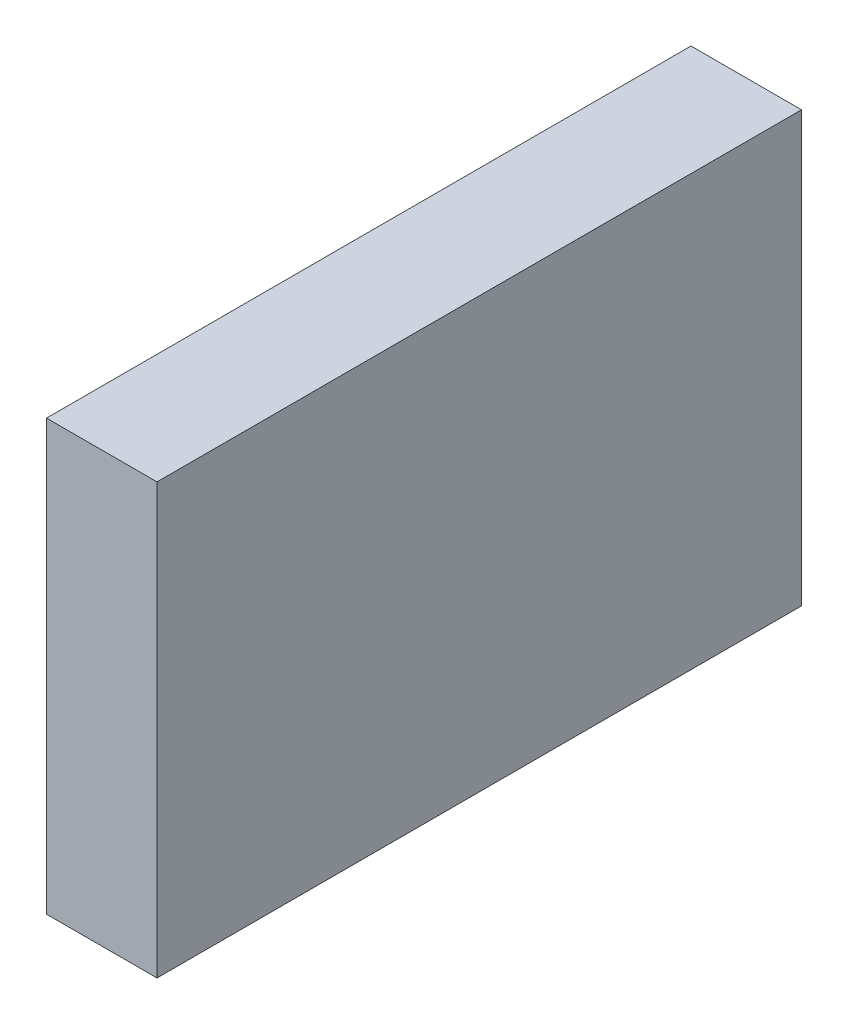
ISO-10303-21;
HEADER;
FILE_DESCRIPTION(('STEP AP214'),'2;1');
FILE_NAME('part.step','',(''),(''),'','','');
FILE_SCHEMA(('AUTOMOTIVE_DESIGN { 1 0 10303 214 1 1 1 1 }'));
ENDSEC;
DATA;
#1=APPLICATION_CONTEXT('core data for automotive mechanical design processes');
#2=APPLICATION_PROTOCOL_DEFINITION('international standard','automotive_design',2000,#1);
#3=PRODUCT_CONTEXT('',#1,'mechanical');
#4=PRODUCT('Part','Part','',(#3));
#5=PRODUCT_RELATED_PRODUCT_CATEGORY('part','',(#4));
#6=PRODUCT_DEFINITION_FORMATION('','',#4);
#7=PRODUCT_DEFINITION_CONTEXT('part definition',#1,'design');
#8=PRODUCT_DEFINITION('design','',#6,#7);
#9=PRODUCT_DEFINITION_SHAPE('','',#8);
#10=(LENGTH_UNIT() NAMED_UNIT(*) SI_UNIT(.MILLI.,.METRE.));
#11=(NAMED_UNIT(*) PLANE_ANGLE_UNIT() SI_UNIT($,.RADIAN.));
#12=(NAMED_UNIT(*) SI_UNIT($,.STERADIAN.) SOLID_ANGLE_UNIT());
#13=UNCERTAINTY_MEASURE_WITH_UNIT(LENGTH_MEASURE(1.E-05),#10,'distance_accuracy_value','');
#14=(GEOMETRIC_REPRESENTATION_CONTEXT(3) GLOBAL_UNCERTAINTY_ASSIGNED_CONTEXT((#13)) GLOBAL_UNIT_ASSIGNED_CONTEXT((#10,
#11,#12)) REPRESENTATION_CONTEXT('',''));
#15=CARTESIAN_POINT('',(0.,0.,0.));
#16=DIRECTION('',(0.,0.,1.));
#17=DIRECTION('',(1.,0.,0.));
#18=AXIS2_PLACEMENT_3D('',#15,#16,#17);
#19=CARTESIAN_POINT('',(0.,14.,0.));
#20=DIRECTION('',(1.,0.,0.));
#21=DIRECTION('',(0.,0.,-1.));
#22=AXIS2_PLACEMENT_3D('',#19,#20,#21);
#23=PLANE('',#22);
#24=DIRECTION('',(0.,0.,1.));
#25=VECTOR('',#24,1.);
#26=CARTESIAN_POINT('',(0.,0.,0.));
#27=LINE('',#26,#25);
#28=CARTESIAN_POINT('',(0.,0.,-21.));
#29=VERTEX_POINT('',#28);
#30=CARTESIAN_POINT('',(0.,0.,0.));
#31=VERTEX_POINT('',#30);
#32=EDGE_CURVE('E96',#29,#31,#27,.T.);
#33=ORIENTED_EDGE('',*,*,#32,.T.);
#34=DIRECTION('',(0.,-1.,0.));
#35=VECTOR('',#34,1.);
#36=CARTESIAN_POINT('',(0.,14.,0.));
#37=LINE('',#36,#35);
#38=CARTESIAN_POINT('',(0.,14.,0.));
#39=VERTEX_POINT('',#38);
#40=EDGE_CURVE('E11',#39,#31,#37,.T.);
#41=ORIENTED_EDGE('',*,*,#40,.F.);
#42=DIRECTION('',(0.,0.,1.));
#43=VECTOR('',#42,1.);
#44=CARTESIAN_POINT('',(0.,14.,0.));
#45=LINE('',#44,#43);
#46=CARTESIAN_POINT('',(0.,14.,-21.));
#47=VERTEX_POINT('',#46);
#48=EDGE_CURVE('E84',#47,#39,#45,.T.);
#49=ORIENTED_EDGE('',*,*,#48,.F.);
#50=DIRECTION('',(0.,-1.,0.));
#51=VECTOR('',#50,1.);
#52=CARTESIAN_POINT('',(0.,14.,-21.));
#53=LINE('',#52,#51);
#54=EDGE_CURVE('E92',#47,#29,#53,.T.);
#55=ORIENTED_EDGE('',*,*,#54,.T.);
#56=EDGE_LOOP('',(#33,#41,#49,#55));
#57=FACE_BOUND('',#56,.T.);
#58=ADVANCED_FACE('F33',(#57),#23,.F.);
#59=CARTESIAN_POINT('',(0.,14.,0.));
#60=DIRECTION('',(0.,0.,-1.));
#61=DIRECTION('',(-1.,0.,0.));
#62=AXIS2_PLACEMENT_3D('',#59,#60,#61);
#63=PLANE('',#62);
#64=DIRECTION('',(1.,0.,0.));
#65=VECTOR('',#64,1.);
#66=CARTESIAN_POINT('',(0.,0.,0.));
#67=LINE('',#66,#65);
#68=CARTESIAN_POINT('',(3.6,0.,0.));
#69=VERTEX_POINT('',#68);
#70=EDGE_CURVE('E88',#31,#69,#67,.T.);
#71=ORIENTED_EDGE('',*,*,#70,.T.);
#72=DIRECTION('',(0.,-1.,0.));
#73=VECTOR('',#72,1.);
#74=CARTESIAN_POINT('',(3.6,14.,0.));
#75=LINE('',#74,#73);
#76=CARTESIAN_POINT('',(3.6,14.,0.));
#77=VERTEX_POINT('',#76);
#78=EDGE_CURVE('E41',#77,#69,#75,.T.);
#79=ORIENTED_EDGE('',*,*,#78,.F.);
#80=DIRECTION('',(1.,0.,0.));
#81=VECTOR('',#80,1.);
#82=CARTESIAN_POINT('',(0.,14.,0.));
#83=LINE('',#82,#81);
#84=EDGE_CURVE('E79',#39,#77,#83,.T.);
#85=ORIENTED_EDGE('',*,*,#84,.F.);
#86=ORIENTED_EDGE('',*,*,#40,.T.);
#87=EDGE_LOOP('',(#71,#79,#85,#86));
#88=FACE_BOUND('',#87,.T.);
#89=ADVANCED_FACE('F87',(#88),#63,.F.);
#90=CARTESIAN_POINT('',(3.6,14.,0.));
#91=DIRECTION('',(-1.,0.,0.));
#92=DIRECTION('',(0.,0.,1.));
#93=AXIS2_PLACEMENT_3D('',#90,#91,#92);
#94=PLANE('',#93);
#95=DIRECTION('',(0.,0.,-1.));
#96=VECTOR('',#95,1.);
#97=CARTESIAN_POINT('',(3.6,0.,0.));
#98=LINE('',#97,#96);
#99=CARTESIAN_POINT('',(3.6,0.,-21.));
#100=VERTEX_POINT('',#99);
#101=EDGE_CURVE('E66',#69,#100,#98,.T.);
#102=ORIENTED_EDGE('',*,*,#101,.T.);
#103=DIRECTION('',(0.,-1.,0.));
#104=VECTOR('',#103,1.);
#105=CARTESIAN_POINT('',(3.6,14.,-21.));
#106=LINE('',#105,#104);
#107=CARTESIAN_POINT('',(3.6,14.,-21.));
#108=VERTEX_POINT('',#107);
#109=EDGE_CURVE('E89',#108,#100,#106,.T.);
#110=ORIENTED_EDGE('',*,*,#109,.F.);
#111=DIRECTION('',(0.,0.,-1.));
#112=VECTOR('',#111,1.);
#113=CARTESIAN_POINT('',(3.6,14.,0.));
#114=LINE('',#113,#112);
#115=EDGE_CURVE('E82',#77,#108,#114,.T.);
#116=ORIENTED_EDGE('',*,*,#115,.F.);
#117=ORIENTED_EDGE('',*,*,#78,.T.);
#118=EDGE_LOOP('',(#102,#110,#116,#117));
#119=FACE_BOUND('',#118,.T.);
#120=ADVANCED_FACE('F90',(#119),#94,.F.);
#121=CARTESIAN_POINT('',(0.,14.,-21.));
#122=DIRECTION('',(0.,0.,1.));
#123=DIRECTION('',(1.,0.,0.));
#124=AXIS2_PLACEMENT_3D('',#121,#122,#123);
#125=PLANE('',#124);
#126=DIRECTION('',(-1.,0.,0.));
#127=VECTOR('',#126,1.);
#128=CARTESIAN_POINT('',(0.,0.,-21.));
#129=LINE('',#128,#127);
#130=EDGE_CURVE('E72',#100,#29,#129,.T.);
#131=ORIENTED_EDGE('',*,*,#130,.T.);
#132=ORIENTED_EDGE('',*,*,#54,.F.);
#133=DIRECTION('',(-1.,0.,0.));
#134=VECTOR('',#133,1.);
#135=CARTESIAN_POINT('',(0.,14.,-21.));
#136=LINE('',#135,#134);
#137=EDGE_CURVE('E49',#108,#47,#136,.T.);
#138=ORIENTED_EDGE('',*,*,#137,.F.);
#139=ORIENTED_EDGE('',*,*,#109,.T.);
#140=EDGE_LOOP('',(#131,#132,#138,#139));
#141=FACE_BOUND('',#140,.T.);
#142=ADVANCED_FACE('F103',(#141),#125,.F.);
#143=CARTESIAN_POINT('',(0.,14.,0.));
#144=DIRECTION('',(0.,-1.,0.));
#145=DIRECTION('',(0.,0.,-1.));
#146=AXIS2_PLACEMENT_3D('',#143,#144,#145);
#147=PLANE('',#146);
#148=ORIENTED_EDGE('',*,*,#48,.T.);
#149=ORIENTED_EDGE('',*,*,#84,.T.);
#150=ORIENTED_EDGE('',*,*,#115,.T.);
#151=ORIENTED_EDGE('',*,*,#137,.T.);
#152=EDGE_LOOP('',(#148,#149,#150,#151));
#153=FACE_BOUND('',#152,.T.);
#154=ADVANCED_FACE('F80',(#153),#147,.F.);
#155=CARTESIAN_POINT('',(0.,0.,0.));
#156=DIRECTION('',(0.,-1.,0.));
#157=DIRECTION('',(0.,0.,-1.));
#158=AXIS2_PLACEMENT_3D('',#155,#156,#157);
#159=PLANE('',#158);
#160=ORIENTED_EDGE('',*,*,#32,.F.);
#161=ORIENTED_EDGE('',*,*,#130,.F.);
#162=ORIENTED_EDGE('',*,*,#101,.F.);
#163=ORIENTED_EDGE('',*,*,#70,.F.);
#164=EDGE_LOOP('',(#160,#161,#162,#163));
#165=FACE_BOUND('',#164,.T.);
#166=ADVANCED_FACE('F106',(#165),#159,.T.);
#167=CLOSED_SHELL('',(#58,#89,#120,#142,#154,#166));
#168=MANIFOLD_SOLID_BREP('B2',#167);
#169=ADVANCED_BREP_SHAPE_REPRESENTATION('',(#18,#168),#14);
#170=SHAPE_DEFINITION_REPRESENTATION(#9,#169);
ENDSEC;
END-ISO-10303-21;
